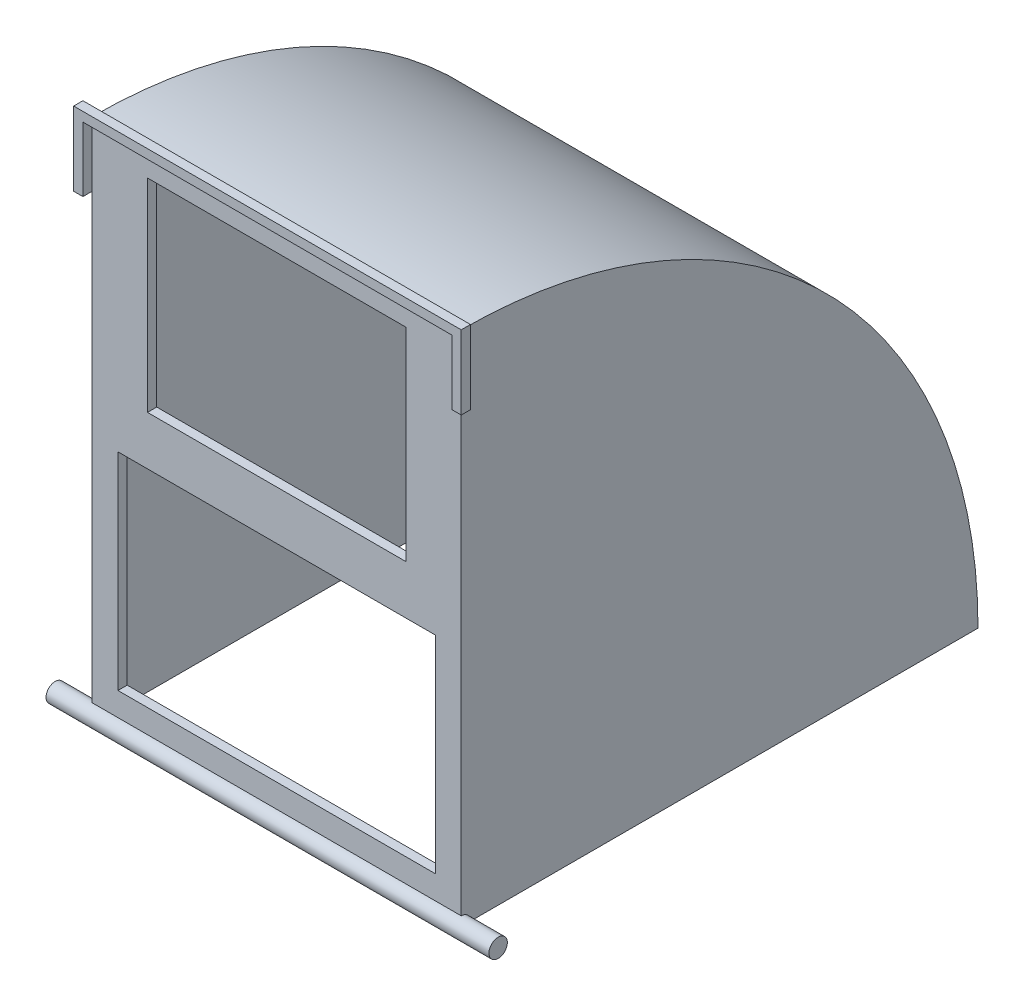
ISO-10303-21;
HEADER;
FILE_DESCRIPTION(('STEP AP214'),'2;1');
FILE_NAME('part.step','',(''),(''),'','','');
FILE_SCHEMA(('AUTOMOTIVE_DESIGN { 1 0 10303 214 1 1 1 1 }'));
ENDSEC;
DATA;
#1=APPLICATION_CONTEXT('core data for automotive mechanical design processes');
#2=APPLICATION_PROTOCOL_DEFINITION('international standard','automotive_design',2000,#1);
#3=PRODUCT_CONTEXT('',#1,'mechanical');
#4=PRODUCT('Part','Part','',(#3));
#5=PRODUCT_RELATED_PRODUCT_CATEGORY('part','',(#4));
#6=PRODUCT_DEFINITION_FORMATION('','',#4);
#7=PRODUCT_DEFINITION_CONTEXT('part definition',#1,'design');
#8=PRODUCT_DEFINITION('design','',#6,#7);
#9=PRODUCT_DEFINITION_SHAPE('','',#8);
#10=(LENGTH_UNIT() NAMED_UNIT(*) SI_UNIT(.MILLI.,.METRE.));
#11=(NAMED_UNIT(*) PLANE_ANGLE_UNIT() SI_UNIT($,.RADIAN.));
#12=(NAMED_UNIT(*) SI_UNIT($,.STERADIAN.) SOLID_ANGLE_UNIT());
#13=UNCERTAINTY_MEASURE_WITH_UNIT(LENGTH_MEASURE(1.E-05),#10,'distance_accuracy_value','');
#14=(GEOMETRIC_REPRESENTATION_CONTEXT(3) GLOBAL_UNCERTAINTY_ASSIGNED_CONTEXT((#13)) GLOBAL_UNIT_ASSIGNED_CONTEXT((#10,
#11,#12)) REPRESENTATION_CONTEXT('',''));
#15=CARTESIAN_POINT('',(0.,0.,0.));
#16=DIRECTION('',(0.,0.,1.));
#17=DIRECTION('',(1.,0.,0.));
#18=AXIS2_PLACEMENT_3D('',#15,#16,#17);
#19=CARTESIAN_POINT('',(127.,155.575,3.175));
#20=DIRECTION('',(1.,0.,0.));
#21=DIRECTION('',(0.,0.,-1.));
#22=AXIS2_PLACEMENT_3D('',#19,#20,#21);
#23=PLANE('',#22);
#24=DIRECTION('',(0.,-1.,0.));
#25=VECTOR('',#24,1.);
#26=CARTESIAN_POINT('',(127.,155.575,0.));
#27=LINE('',#26,#25);
#28=CARTESIAN_POINT('',(127.,177.8,0.));
#29=VERTEX_POINT('',#28);
#30=CARTESIAN_POINT('',(127.,155.575,0.));
#31=VERTEX_POINT('',#30);
#32=EDGE_CURVE('E140',#29,#31,#27,.T.);
#33=ORIENTED_EDGE('',*,*,#32,.T.);
#34=DIRECTION('',(0.,0.,-1.));
#35=VECTOR('',#34,1.);
#36=CARTESIAN_POINT('',(127.,155.575,3.175));
#37=LINE('',#36,#35);
#38=CARTESIAN_POINT('',(127.,155.575,3.175));
#39=VERTEX_POINT('',#38);
#40=EDGE_CURVE('E12',#39,#31,#37,.T.);
#41=ORIENTED_EDGE('',*,*,#40,.F.);
#42=DIRECTION('',(0.,-1.,0.));
#43=VECTOR('',#42,1.);
#44=CARTESIAN_POINT('',(127.,155.575,3.175));
#45=LINE('',#44,#43);
#46=CARTESIAN_POINT('',(127.,177.8,3.175));
#47=VERTEX_POINT('',#46);
#48=EDGE_CURVE('E154',#47,#39,#45,.T.);
#49=ORIENTED_EDGE('',*,*,#48,.F.);
#50=DIRECTION('',(0.,0.,-1.));
#51=VECTOR('',#50,1.);
#52=CARTESIAN_POINT('',(127.,177.8,3.175));
#53=LINE('',#52,#51);
#54=EDGE_CURVE('E136',#47,#29,#53,.T.);
#55=ORIENTED_EDGE('',*,*,#54,.T.);
#56=EDGE_LOOP('',(#33,#41,#49,#55));
#57=FACE_BOUND('',#56,.T.);
#58=ADVANCED_FACE('F44',(#57),#23,.F.);
#59=CARTESIAN_POINT('',(127.,155.575,3.175));
#60=DIRECTION('',(0.,1.,0.));
#61=DIRECTION('',(0.,0.,1.));
#62=AXIS2_PLACEMENT_3D('',#59,#60,#61);
#63=PLANE('',#62);
#64=DIRECTION('',(1.,0.,0.));
#65=VECTOR('',#64,1.);
#66=CARTESIAN_POINT('',(127.,155.575,0.));
#67=LINE('',#66,#65);
#68=CARTESIAN_POINT('',(130.175,155.575,0.));
#69=VERTEX_POINT('',#68);
#70=EDGE_CURVE('E143',#31,#69,#67,.T.);
#71=ORIENTED_EDGE('',*,*,#70,.T.);
#72=DIRECTION('',(0.,0.,-1.));
#73=VECTOR('',#72,1.);
#74=CARTESIAN_POINT('',(130.175,155.575,3.175));
#75=LINE('',#74,#73);
#76=CARTESIAN_POINT('',(130.175,155.575,3.175));
#77=VERTEX_POINT('',#76);
#78=EDGE_CURVE('E52',#77,#69,#75,.T.);
#79=ORIENTED_EDGE('',*,*,#78,.F.);
#80=DIRECTION('',(1.,0.,0.));
#81=VECTOR('',#80,1.);
#82=CARTESIAN_POINT('',(127.,155.575,3.175));
#83=LINE('',#82,#81);
#84=EDGE_CURVE('E103',#39,#77,#83,.T.);
#85=ORIENTED_EDGE('',*,*,#84,.F.);
#86=ORIENTED_EDGE('',*,*,#40,.T.);
#87=EDGE_LOOP('',(#71,#79,#85,#86));
#88=FACE_BOUND('',#87,.T.);
#89=ADVANCED_FACE('F189',(#88),#63,.F.);
#90=CARTESIAN_POINT('',(130.175,180.975,3.175));
#91=DIRECTION('',(-1.,0.,0.));
#92=DIRECTION('',(0.,0.,1.));
#93=AXIS2_PLACEMENT_3D('',#90,#91,#92);
#94=PLANE('',#93);
#95=DIRECTION('',(0.,1.,0.));
#96=VECTOR('',#95,1.);
#97=CARTESIAN_POINT('',(130.175,180.975,0.));
#98=LINE('',#97,#96);
#99=CARTESIAN_POINT('',(130.175,180.975,0.));
#100=VERTEX_POINT('',#99);
#101=EDGE_CURVE('E145',#69,#100,#98,.T.);
#102=ORIENTED_EDGE('',*,*,#101,.T.);
#103=DIRECTION('',(0.,0.,-1.));
#104=VECTOR('',#103,1.);
#105=CARTESIAN_POINT('',(130.175,180.975,3.175));
#106=LINE('',#105,#104);
#107=CARTESIAN_POINT('',(130.175,180.975,3.175));
#108=VERTEX_POINT('',#107);
#109=EDGE_CURVE('E161',#108,#100,#106,.T.);
#110=ORIENTED_EDGE('',*,*,#109,.F.);
#111=DIRECTION('',(0.,1.,0.));
#112=VECTOR('',#111,1.);
#113=CARTESIAN_POINT('',(130.175,180.975,3.175));
#114=LINE('',#113,#112);
#115=EDGE_CURVE('E169',#77,#108,#114,.T.);
#116=ORIENTED_EDGE('',*,*,#115,.F.);
#117=ORIENTED_EDGE('',*,*,#78,.T.);
#118=EDGE_LOOP('',(#102,#110,#116,#117));
#119=FACE_BOUND('',#118,.T.);
#120=ADVANCED_FACE('F167',(#119),#94,.F.);
#121=CARTESIAN_POINT('',(-3.17500000000001,180.975,3.175));
#122=DIRECTION('',(0.,-1.,0.));
#123=DIRECTION('',(0.,0.,-1.));
#124=AXIS2_PLACEMENT_3D('',#121,#122,#123);
#125=PLANE('',#124);
#126=DIRECTION('',(-1.,0.,0.));
#127=VECTOR('',#126,1.);
#128=CARTESIAN_POINT('',(-3.17500000000001,180.975,0.));
#129=LINE('',#128,#127);
#130=CARTESIAN_POINT('',(-3.17500000000001,180.975,0.));
#131=VERTEX_POINT('',#130);
#132=EDGE_CURVE('E147',#100,#131,#129,.T.);
#133=ORIENTED_EDGE('',*,*,#132,.T.);
#134=DIRECTION('',(0.,0.,-1.));
#135=VECTOR('',#134,1.);
#136=CARTESIAN_POINT('',(-3.17500000000001,180.975,3.175));
#137=LINE('',#136,#135);
#138=CARTESIAN_POINT('',(-3.17500000000001,180.975,3.175));
#139=VERTEX_POINT('',#138);
#140=EDGE_CURVE('E158',#139,#131,#137,.T.);
#141=ORIENTED_EDGE('',*,*,#140,.F.);
#142=DIRECTION('',(-1.,0.,0.));
#143=VECTOR('',#142,1.);
#144=CARTESIAN_POINT('',(-3.17500000000001,180.975,3.175));
#145=LINE('',#144,#143);
#146=EDGE_CURVE('E181',#108,#139,#145,.T.);
#147=ORIENTED_EDGE('',*,*,#146,.F.);
#148=ORIENTED_EDGE('',*,*,#109,.T.);
#149=EDGE_LOOP('',(#133,#141,#147,#148));
#150=FACE_BOUND('',#149,.T.);
#151=ADVANCED_FACE('F177',(#150),#125,.F.);
#152=CARTESIAN_POINT('',(-3.17500000000001,155.575,3.175));
#153=DIRECTION('',(1.,0.,0.));
#154=DIRECTION('',(0.,0.,-1.));
#155=AXIS2_PLACEMENT_3D('',#152,#153,#154);
#156=PLANE('',#155);
#157=DIRECTION('',(0.,-1.,0.));
#158=VECTOR('',#157,1.);
#159=CARTESIAN_POINT('',(-3.17500000000001,155.575,0.));
#160=LINE('',#159,#158);
#161=CARTESIAN_POINT('',(-3.17500000000001,155.575,0.));
#162=VERTEX_POINT('',#161);
#163=EDGE_CURVE('E149',#131,#162,#160,.T.);
#164=ORIENTED_EDGE('',*,*,#163,.T.);
#165=DIRECTION('',(0.,0.,-1.));
#166=VECTOR('',#165,1.);
#167=CARTESIAN_POINT('',(-3.17500000000001,155.575,3.175));
#168=LINE('',#167,#166);
#169=CARTESIAN_POINT('',(-3.17500000000001,155.575,3.175));
#170=VERTEX_POINT('',#169);
#171=EDGE_CURVE('E131',#170,#162,#168,.T.);
#172=ORIENTED_EDGE('',*,*,#171,.F.);
#173=DIRECTION('',(0.,-1.,0.));
#174=VECTOR('',#173,1.);
#175=CARTESIAN_POINT('',(-3.17500000000001,155.575,3.175));
#176=LINE('',#175,#174);
#177=EDGE_CURVE('E122',#139,#170,#176,.T.);
#178=ORIENTED_EDGE('',*,*,#177,.F.);
#179=ORIENTED_EDGE('',*,*,#140,.T.);
#180=EDGE_LOOP('',(#164,#172,#178,#179));
#181=FACE_BOUND('',#180,.T.);
#182=ADVANCED_FACE('F180',(#181),#156,.F.);
#183=CARTESIAN_POINT('',(0.,155.575,3.175));
#184=DIRECTION('',(0.,1.,0.));
#185=DIRECTION('',(0.,0.,1.));
#186=AXIS2_PLACEMENT_3D('',#183,#184,#185);
#187=PLANE('',#186);
#188=DIRECTION('',(1.,0.,0.));
#189=VECTOR('',#188,1.);
#190=CARTESIAN_POINT('',(0.,155.575,0.));
#191=LINE('',#190,#189);
#192=CARTESIAN_POINT('',(0.,155.575,0.));
#193=VERTEX_POINT('',#192);
#194=EDGE_CURVE('E130',#162,#193,#191,.T.);
#195=ORIENTED_EDGE('',*,*,#194,.T.);
#196=DIRECTION('',(0.,0.,-1.));
#197=VECTOR('',#196,1.);
#198=CARTESIAN_POINT('',(0.,155.575,3.175));
#199=LINE('',#198,#197);
#200=CARTESIAN_POINT('',(0.,155.575,3.175));
#201=VERTEX_POINT('',#200);
#202=EDGE_CURVE('E127',#201,#193,#199,.T.);
#203=ORIENTED_EDGE('',*,*,#202,.F.);
#204=DIRECTION('',(1.,0.,0.));
#205=VECTOR('',#204,1.);
#206=CARTESIAN_POINT('',(0.,155.575,3.175));
#207=LINE('',#206,#205);
#208=EDGE_CURVE('E116',#170,#201,#207,.T.);
#209=ORIENTED_EDGE('',*,*,#208,.F.);
#210=ORIENTED_EDGE('',*,*,#171,.T.);
#211=EDGE_LOOP('',(#195,#203,#209,#210));
#212=FACE_BOUND('',#211,.T.);
#213=ADVANCED_FACE('F128',(#212),#187,.F.);
#214=CARTESIAN_POINT('',(0.,155.575,3.175));
#215=DIRECTION('',(-1.,0.,0.));
#216=DIRECTION('',(0.,-1.,0.));
#217=AXIS2_PLACEMENT_3D('',#214,#215,#216);
#218=PLANE('',#217);
#219=DIRECTION('',(0.,1.,0.));
#220=VECTOR('',#219,1.);
#221=CARTESIAN_POINT('',(0.,155.575,0.));
#222=LINE('',#221,#220);
#223=CARTESIAN_POINT('',(0.,177.8,0.));
#224=VERTEX_POINT('',#223);
#225=EDGE_CURVE('E89',#193,#224,#222,.T.);
#226=ORIENTED_EDGE('',*,*,#225,.T.);
#227=DIRECTION('',(0.,0.,-1.));
#228=VECTOR('',#227,1.);
#229=CARTESIAN_POINT('',(0.,177.8,3.175));
#230=LINE('',#229,#228);
#231=CARTESIAN_POINT('',(0.,177.8,3.175));
#232=VERTEX_POINT('',#231);
#233=EDGE_CURVE('E132',#232,#224,#230,.T.);
#234=ORIENTED_EDGE('',*,*,#233,.F.);
#235=DIRECTION('',(0.,1.,0.));
#236=VECTOR('',#235,1.);
#237=CARTESIAN_POINT('',(0.,155.575,3.175));
#238=LINE('',#237,#236);
#239=EDGE_CURVE('E120',#201,#232,#238,.T.);
#240=ORIENTED_EDGE('',*,*,#239,.F.);
#241=ORIENTED_EDGE('',*,*,#202,.T.);
#242=EDGE_LOOP('',(#226,#234,#240,#241));
#243=FACE_BOUND('',#242,.T.);
#244=ADVANCED_FACE('F134',(#243),#218,.F.);
#245=CARTESIAN_POINT('',(127.,177.8,3.175));
#246=DIRECTION('',(0.,1.,0.));
#247=DIRECTION('',(0.,0.,1.));
#248=AXIS2_PLACEMENT_3D('',#245,#246,#247);
#249=PLANE('',#248);
#250=DIRECTION('',(1.,0.,0.));
#251=VECTOR('',#250,1.);
#252=CARTESIAN_POINT('',(127.,177.8,0.));
#253=LINE('',#252,#251);
#254=EDGE_CURVE('E95',#224,#29,#253,.T.);
#255=ORIENTED_EDGE('',*,*,#254,.T.);
#256=ORIENTED_EDGE('',*,*,#54,.F.);
#257=DIRECTION('',(1.,0.,0.));
#258=VECTOR('',#257,1.);
#259=CARTESIAN_POINT('',(127.,177.8,3.175));
#260=LINE('',#259,#258);
#261=EDGE_CURVE('E60',#232,#47,#260,.T.);
#262=ORIENTED_EDGE('',*,*,#261,.F.);
#263=ORIENTED_EDGE('',*,*,#233,.T.);
#264=EDGE_LOOP('',(#255,#256,#262,#263));
#265=FACE_BOUND('',#264,.T.);
#266=ADVANCED_FACE('F205',(#265),#249,.F.);
#267=CARTESIAN_POINT('',(0.,0.,3.175));
#268=DIRECTION('',(0.,0.,1.));
#269=DIRECTION('',(1.,0.,0.));
#270=AXIS2_PLACEMENT_3D('',#267,#268,#269);
#271=PLANE('',#270);
#272=ORIENTED_EDGE('',*,*,#48,.T.);
#273=ORIENTED_EDGE('',*,*,#84,.T.);
#274=ORIENTED_EDGE('',*,*,#115,.T.);
#275=ORIENTED_EDGE('',*,*,#146,.T.);
#276=ORIENTED_EDGE('',*,*,#177,.T.);
#277=ORIENTED_EDGE('',*,*,#208,.T.);
#278=ORIENTED_EDGE('',*,*,#239,.T.);
#279=ORIENTED_EDGE('',*,*,#261,.T.);
#280=EDGE_LOOP('',(#272,#273,#274,#275,#276,#277,#278,#279));
#281=FACE_BOUND('',#280,.T.);
#282=ADVANCED_FACE('F118',(#281),#271,.T.);
#283=CARTESIAN_POINT('',(0.,0.,0.));
#284=DIRECTION('',(0.,0.,1.));
#285=DIRECTION('',(1.,0.,0.));
#286=AXIS2_PLACEMENT_3D('',#283,#284,#285);
#287=PLANE('',#286);
#288=ORIENTED_EDGE('',*,*,#32,.F.);
#289=ORIENTED_EDGE('',*,*,#254,.F.);
#290=ORIENTED_EDGE('',*,*,#225,.F.);
#291=ORIENTED_EDGE('',*,*,#194,.F.);
#292=ORIENTED_EDGE('',*,*,#163,.F.);
#293=ORIENTED_EDGE('',*,*,#132,.F.);
#294=ORIENTED_EDGE('',*,*,#101,.F.);
#295=ORIENTED_EDGE('',*,*,#70,.F.);
#296=EDGE_LOOP('',(#288,#289,#290,#291,#292,#293,#294,#295));
#297=FACE_BOUND('',#296,.T.);
#298=ADVANCED_FACE('F173',(#297),#287,.F.);
#299=CLOSED_SHELL('',(#58,#89,#120,#151,#182,#213,#244,#266,#282,#298));
#300=MANIFOLD_SOLID_BREP('B2',#299);
#301=CARTESIAN_POINT('',(139.701,174.596133977817,-3.175));
#302=DIRECTION('',(0.,0.,1.));
#303=DIRECTION('',(1.,0.,0.));
#304=AXIS2_PLACEMENT_3D('',#301,#302,#303);
#305=PLANE('',#304);
#306=DIRECTION('',(0.,-1.,0.));
#307=VECTOR('',#306,1.);
#308=CARTESIAN_POINT('',(19.05,174.596133977817,-3.175));
#309=LINE('',#308,#307);
#310=CARTESIAN_POINT('',(19.05,169.06875,-3.175));
#311=VERTEX_POINT('',#310);
#312=CARTESIAN_POINT('',(19.05,99.21875,-3.175));
#313=VERTEX_POINT('',#312);
#314=EDGE_CURVE('E466',#311,#313,#309,.T.);
#315=ORIENTED_EDGE('',*,*,#314,.T.);
#316=DIRECTION('',(1.,0.,0.));
#317=VECTOR('',#316,1.);
#318=CARTESIAN_POINT('',(139.701,99.21875,-3.175));
#319=LINE('',#318,#317);
#320=CARTESIAN_POINT('',(107.95,99.21875,-3.175));
#321=VERTEX_POINT('',#320);
#322=EDGE_CURVE('E458',#313,#321,#319,.T.);
#323=ORIENTED_EDGE('',*,*,#322,.T.);
#324=DIRECTION('',(0.,1.,0.));
#325=VECTOR('',#324,1.);
#326=CARTESIAN_POINT('',(107.95,174.596133977817,-3.175));
#327=LINE('',#326,#325);
#328=CARTESIAN_POINT('',(107.95,169.06875,-3.175));
#329=VERTEX_POINT('',#328);
#330=EDGE_CURVE('E462',#321,#329,#327,.T.);
#331=ORIENTED_EDGE('',*,*,#330,.T.);
#332=DIRECTION('',(-1.,0.,0.));
#333=VECTOR('',#332,1.);
#334=CARTESIAN_POINT('',(139.701,169.06875,-3.175));
#335=LINE('',#334,#333);
#336=EDGE_CURVE('E464',#329,#311,#335,.T.);
#337=ORIENTED_EDGE('',*,*,#336,.T.);
#338=EDGE_LOOP('',(#315,#323,#331,#337));
#339=FACE_BOUND('',#338,.T.);
#340=DIRECTION('',(0.,-1.,0.));
#341=VECTOR('',#340,1.);
#342=CARTESIAN_POINT('',(8.89000000000001,174.596133977817,-3.175));
#343=LINE('',#342,#341);
#344=CARTESIAN_POINT('',(8.89000000000001,82.39125,-3.175));
#345=VERTEX_POINT('',#344);
#346=CARTESIAN_POINT('',(8.89000000000003,11.27125,-3.175));
#347=VERTEX_POINT('',#346);
#348=EDGE_CURVE('E474',#345,#347,#343,.T.);
#349=ORIENTED_EDGE('',*,*,#348,.T.);
#350=DIRECTION('',(1.,0.,0.));
#351=VECTOR('',#350,1.);
#352=CARTESIAN_POINT('',(139.701,11.27125,-3.175));
#353=LINE('',#352,#351);
#354=CARTESIAN_POINT('',(118.11,11.27125,-3.175));
#355=VERTEX_POINT('',#354);
#356=EDGE_CURVE('E468',#347,#355,#353,.T.);
#357=ORIENTED_EDGE('',*,*,#356,.T.);
#358=DIRECTION('',(0.,1.,0.));
#359=VECTOR('',#358,1.);
#360=CARTESIAN_POINT('',(118.11,174.596133977817,-3.175));
#361=LINE('',#360,#359);
#362=CARTESIAN_POINT('',(118.11,82.39125,-3.175));
#363=VERTEX_POINT('',#362);
#364=EDGE_CURVE('E470',#355,#363,#361,.T.);
#365=ORIENTED_EDGE('',*,*,#364,.T.);
#366=DIRECTION('',(-1.,0.,0.));
#367=VECTOR('',#366,1.);
#368=CARTESIAN_POINT('',(139.701,82.39125,-3.175));
#369=LINE('',#368,#367);
#370=EDGE_CURVE('E472',#363,#345,#369,.T.);
#371=ORIENTED_EDGE('',*,*,#370,.T.);
#372=EDGE_LOOP('',(#349,#357,#365,#371));
#373=FACE_BOUND('',#372,.T.);
#374=DIRECTION('',(0.,1.,0.));
#375=VECTOR('',#374,1.);
#376=CARTESIAN_POINT('',(123.825,174.596133977817,-3.175));
#377=LINE('',#376,#375);
#378=CARTESIAN_POINT('',(123.825,3.17500000000001,-3.175));
#379=VERTEX_POINT('',#378);
#380=CARTESIAN_POINT('',(123.825,174.596133977817,-3.17499999999998));
#381=VERTEX_POINT('',#380);
#382=EDGE_CURVE('E286',#379,#381,#377,.T.);
#383=ORIENTED_EDGE('',*,*,#382,.F.);
#384=DIRECTION('',(-1.,0.,0.));
#385=VECTOR('',#384,1.);
#386=CARTESIAN_POINT('',(139.701,3.17500000000001,-3.175));
#387=LINE('',#386,#385);
#388=CARTESIAN_POINT('',(3.17500000000001,3.17500000000001,-3.175));
#389=VERTEX_POINT('',#388);
#390=EDGE_CURVE('E408',#379,#389,#387,.T.);
#391=ORIENTED_EDGE('',*,*,#390,.T.);
#392=DIRECTION('',(0.,-1.,0.));
#393=VECTOR('',#392,1.);
#394=CARTESIAN_POINT('',(3.17500000000001,174.596133977817,-3.175));
#395=LINE('',#394,#393);
#396=CARTESIAN_POINT('',(3.17500000000001,174.596133977817,-3.17499999999998));
#397=VERTEX_POINT('',#396);
#398=EDGE_CURVE('E422',#397,#389,#395,.T.);
#399=ORIENTED_EDGE('',*,*,#398,.F.);
#400=DIRECTION('',(-1.,0.,0.));
#401=VECTOR('',#400,1.);
#402=CARTESIAN_POINT('',(139.701,174.596133977817,-3.17499999999998));
#403=LINE('',#402,#401);
#404=EDGE_CURVE('E409',#381,#397,#403,.T.);
#405=ORIENTED_EDGE('',*,*,#404,.F.);
#406=EDGE_LOOP('',(#383,#391,#399,#405));
#407=FACE_BOUND('',#406,.T.);
#408=ADVANCED_FACE('F271',(#339,#373,#407),#305,.F.);
#409=CARTESIAN_POINT('',(139.701,3.17500000000001,-3.175));
#410=DIRECTION('',(0.,-1.,0.));
#411=DIRECTION('',(0.,0.,-1.));
#412=AXIS2_PLACEMENT_3D('',#409,#410,#411);
#413=PLANE('',#412);
#414=DIRECTION('',(0.,0.,1.));
#415=VECTOR('',#414,1.);
#416=CARTESIAN_POINT('',(123.825,3.17500000000001,-3.175));
#417=LINE('',#416,#415);
#418=CARTESIAN_POINT('',(123.825,3.17500000000001,-6.35));
#419=VERTEX_POINT('',#418);
#420=EDGE_CURVE('E424',#419,#379,#417,.T.);
#421=ORIENTED_EDGE('',*,*,#420,.F.);
#422=DIRECTION('',(1.,0.,0.));
#423=VECTOR('',#422,1.);
#424=CARTESIAN_POINT('',(123.825,3.17500000000001,-6.35));
#425=LINE('',#424,#423);
#426=CARTESIAN_POINT('',(3.175,3.17500000000001,-6.35));
#427=VERTEX_POINT('',#426);
#428=EDGE_CURVE('E434',#427,#419,#425,.T.);
#429=ORIENTED_EDGE('',*,*,#428,.F.);
#430=DIRECTION('',(0.,0.,-1.));
#431=VECTOR('',#430,1.);
#432=CARTESIAN_POINT('',(3.17500000000001,3.17500000000001,-3.175));
#433=LINE('',#432,#431);
#434=EDGE_CURVE('E428',#389,#427,#433,.T.);
#435=ORIENTED_EDGE('',*,*,#434,.F.);
#436=ORIENTED_EDGE('',*,*,#390,.F.);
#437=EDGE_LOOP('',(#421,#429,#435,#436));
#438=FACE_BOUND('',#437,.T.);
#439=ADVANCED_FACE('F589',(#438),#413,.F.);
#440=CARTESIAN_POINT('',(139.701,0.,0.));
#441=DIRECTION('',(-1.,0.,0.));
#442=DIRECTION('',(0.,0.,1.));
#443=AXIS2_PLACEMENT_3D('',#440,#441,#442);
#444=CYLINDRICAL_SURFACE('',#443,174.625);
#445=CARTESIAN_POINT('',(123.825,0.,0.));
#446=DIRECTION('',(1.,0.,0.));
#447=DIRECTION('',(0.,0.,-1.));
#448=AXIS2_PLACEMENT_3D('',#445,#446,#447);
#449=CIRCLE('',#448,174.625);
#450=CARTESIAN_POINT('',(123.825,3.175,-174.596133977817));
#451=VERTEX_POINT('',#450);
#452=EDGE_CURVE('E294',#381,#451,#449,.F.);
#453=ORIENTED_EDGE('',*,*,#452,.F.);
#454=ORIENTED_EDGE('',*,*,#404,.T.);
#455=CARTESIAN_POINT('',(3.17500000000001,0.,0.));
#456=DIRECTION('',(-1.,0.,0.));
#457=DIRECTION('',(0.,0.,1.));
#458=AXIS2_PLACEMENT_3D('',#455,#456,#457);
#459=CIRCLE('',#458,174.625);
#460=CARTESIAN_POINT('',(3.175,3.17500000000001,-174.596133977817));
#461=VERTEX_POINT('',#460);
#462=EDGE_CURVE('E404',#461,#397,#459,.F.);
#463=ORIENTED_EDGE('',*,*,#462,.F.);
#464=DIRECTION('',(-1.,0.,0.));
#465=VECTOR('',#464,1.);
#466=CARTESIAN_POINT('',(139.701,3.175,-174.596133977817));
#467=LINE('',#466,#465);
#468=EDGE_CURVE('E400',#451,#461,#467,.T.);
#469=ORIENTED_EDGE('',*,*,#468,.F.);
#470=EDGE_LOOP('',(#453,#454,#463,#469));
#471=FACE_BOUND('',#470,.T.);
#472=ADVANCED_FACE('F402',(#471),#444,.F.);
#473=CARTESIAN_POINT('',(127.,0.,0.));
#474=DIRECTION('',(0.,1.,0.));
#475=DIRECTION('',(0.,0.,1.));
#476=AXIS2_PLACEMENT_3D('',#473,#474,#475);
#477=PLANE('',#476);
#478=DIRECTION('',(0.,0.,1.));
#479=VECTOR('',#478,1.);
#480=CARTESIAN_POINT('',(123.825,0.,-174.625));
#481=LINE('',#480,#479);
#482=CARTESIAN_POINT('',(123.825,0.,-174.625));
#483=VERTEX_POINT('',#482);
#484=CARTESIAN_POINT('',(123.825,0.,-6.35));
#485=VERTEX_POINT('',#484);
#486=EDGE_CURVE('E443',#483,#485,#481,.T.);
#487=ORIENTED_EDGE('',*,*,#486,.F.);
#488=DIRECTION('',(1.,0.,0.));
#489=VECTOR('',#488,1.);
#490=CARTESIAN_POINT('',(3.175,0.,-174.625));
#491=LINE('',#490,#489);
#492=CARTESIAN_POINT('',(3.175,0.,-174.625));
#493=VERTEX_POINT('',#492);
#494=EDGE_CURVE('E430',#493,#483,#491,.T.);
#495=ORIENTED_EDGE('',*,*,#494,.F.);
#496=DIRECTION('',(0.,0.,-1.));
#497=VECTOR('',#496,1.);
#498=CARTESIAN_POINT('',(3.175,0.,-6.35));
#499=LINE('',#498,#497);
#500=CARTESIAN_POINT('',(3.175,0.,-6.35));
#501=VERTEX_POINT('',#500);
#502=EDGE_CURVE('E448',#501,#493,#499,.T.);
#503=ORIENTED_EDGE('',*,*,#502,.F.);
#504=DIRECTION('',(-1.,0.,0.));
#505=VECTOR('',#504,1.);
#506=CARTESIAN_POINT('',(123.825,0.,-6.35));
#507=LINE('',#506,#505);
#508=EDGE_CURVE('E445',#485,#501,#507,.T.);
#509=ORIENTED_EDGE('',*,*,#508,.F.);
#510=EDGE_LOOP('',(#487,#495,#503,#509));
#511=FACE_BOUND('',#510,.T.);
#512=DIRECTION('',(0.,0.,-1.));
#513=VECTOR('',#512,1.);
#514=CARTESIAN_POINT('',(127.,0.,0.));
#515=LINE('',#514,#513);
#516=CARTESIAN_POINT('',(127.,0.,-3.175));
#517=VERTEX_POINT('',#516);
#518=CARTESIAN_POINT('',(127.,0.,-177.8));
#519=VERTEX_POINT('',#518);
#520=EDGE_CURVE('E531',#517,#519,#515,.T.);
#521=ORIENTED_EDGE('',*,*,#520,.F.);
#522=DIRECTION('',(1.,0.,0.));
#523=VECTOR('',#522,1.);
#524=CARTESIAN_POINT('',(-12.7,0.,-3.175));
#525=LINE('',#524,#523);
#526=CARTESIAN_POINT('',(0.,0.,-3.175));
#527=VERTEX_POINT('',#526);
#528=EDGE_CURVE('E525',#517,#527,#525,.F.);
#529=ORIENTED_EDGE('',*,*,#528,.T.);
#530=DIRECTION('',(0.,0.,-1.));
#531=VECTOR('',#530,1.);
#532=CARTESIAN_POINT('',(0.,0.,0.));
#533=LINE('',#532,#531);
#534=CARTESIAN_POINT('',(0.,0.,-177.8));
#535=VERTEX_POINT('',#534);
#536=EDGE_CURVE('E530',#527,#535,#533,.T.);
#537=ORIENTED_EDGE('',*,*,#536,.T.);
#538=DIRECTION('',(-1.,0.,0.));
#539=VECTOR('',#538,1.);
#540=CARTESIAN_POINT('',(127.,0.,-177.8));
#541=LINE('',#540,#539);
#542=EDGE_CURVE('E279',#519,#535,#541,.T.);
#543=ORIENTED_EDGE('',*,*,#542,.F.);
#544=EDGE_LOOP('',(#521,#529,#537,#543));
#545=FACE_BOUND('',#544,.T.);
#546=ADVANCED_FACE('F273',(#511,#545),#477,.F.);
#547=CARTESIAN_POINT('',(127.,0.,0.));
#548=DIRECTION('',(-1.,0.,0.));
#549=DIRECTION('',(0.,0.,1.));
#550=AXIS2_PLACEMENT_3D('',#547,#548,#549);
#551=CYLINDRICAL_SURFACE('',#550,177.8);
#552=CARTESIAN_POINT('',(0.,0.,0.));
#553=DIRECTION('',(1.,0.,0.));
#554=DIRECTION('',(0.,0.,-1.));
#555=AXIS2_PLACEMENT_3D('',#552,#553,#554);
#556=CIRCLE('',#555,177.8);
#557=CARTESIAN_POINT('',(0.,177.8,0.));
#558=VERTEX_POINT('',#557);
#559=EDGE_CURVE('E541',#535,#558,#556,.T.);
#560=ORIENTED_EDGE('',*,*,#559,.T.);
#561=DIRECTION('',(-1.,0.,0.));
#562=VECTOR('',#561,1.);
#563=CARTESIAN_POINT('',(127.,177.8,0.));
#564=LINE('',#563,#562);
#565=CARTESIAN_POINT('',(127.,177.8,0.));
#566=VERTEX_POINT('',#565);
#567=EDGE_CURVE('E539',#566,#558,#564,.T.);
#568=ORIENTED_EDGE('',*,*,#567,.F.);
#569=CARTESIAN_POINT('',(127.,0.,0.));
#570=DIRECTION('',(1.,0.,0.));
#571=DIRECTION('',(0.,0.,-1.));
#572=AXIS2_PLACEMENT_3D('',#569,#570,#571);
#573=CIRCLE('',#572,177.8);
#574=EDGE_CURVE('E533',#519,#566,#573,.T.);
#575=ORIENTED_EDGE('',*,*,#574,.F.);
#576=ORIENTED_EDGE('',*,*,#542,.T.);
#577=EDGE_LOOP('',(#560,#568,#575,#576));
#578=FACE_BOUND('',#577,.T.);
#579=ADVANCED_FACE('F550',(#578),#551,.T.);
#580=CARTESIAN_POINT('',(127.,0.,0.));
#581=DIRECTION('',(0.,0.,-1.));
#582=DIRECTION('',(-1.,0.,0.));
#583=AXIS2_PLACEMENT_3D('',#580,#581,#582);
#584=PLANE('',#583);
#585=DIRECTION('',(1.,0.,0.));
#586=VECTOR('',#585,1.);
#587=CARTESIAN_POINT('',(107.95,99.21875,0.));
#588=LINE('',#587,#586);
#589=CARTESIAN_POINT('',(19.05,99.21875,0.));
#590=VERTEX_POINT('',#589);
#591=CARTESIAN_POINT('',(107.95,99.21875,0.));
#592=VERTEX_POINT('',#591);
#593=EDGE_CURVE('E480',#590,#592,#588,.T.);
#594=ORIENTED_EDGE('',*,*,#593,.F.);
#595=DIRECTION('',(0.,-1.,0.));
#596=VECTOR('',#595,1.);
#597=CARTESIAN_POINT('',(19.05,169.06875,0.));
#598=LINE('',#597,#596);
#599=CARTESIAN_POINT('',(19.05,169.06875,0.));
#600=VERTEX_POINT('',#599);
#601=EDGE_CURVE('E477',#600,#590,#598,.T.);
#602=ORIENTED_EDGE('',*,*,#601,.F.);
#603=DIRECTION('',(-1.,0.,0.));
#604=VECTOR('',#603,1.);
#605=CARTESIAN_POINT('',(107.95,169.06875,0.));
#606=LINE('',#605,#604);
#607=CARTESIAN_POINT('',(107.95,169.06875,0.));
#608=VERTEX_POINT('',#607);
#609=EDGE_CURVE('E487',#608,#600,#606,.T.);
#610=ORIENTED_EDGE('',*,*,#609,.F.);
#611=DIRECTION('',(0.,1.,0.));
#612=VECTOR('',#611,1.);
#613=CARTESIAN_POINT('',(107.95,169.06875,0.));
#614=LINE('',#613,#612);
#615=EDGE_CURVE('E484',#592,#608,#614,.T.);
#616=ORIENTED_EDGE('',*,*,#615,.F.);
#617=EDGE_LOOP('',(#594,#602,#610,#616));
#618=FACE_BOUND('',#617,.T.);
#619=DIRECTION('',(1.,0.,0.));
#620=VECTOR('',#619,1.);
#621=CARTESIAN_POINT('',(118.11,11.27125,0.));
#622=LINE('',#621,#620);
#623=CARTESIAN_POINT('',(8.89000000000004,11.27125,0.));
#624=VERTEX_POINT('',#623);
#625=CARTESIAN_POINT('',(118.11,11.27125,0.));
#626=VERTEX_POINT('',#625);
#627=EDGE_CURVE('E501',#624,#626,#622,.T.);
#628=ORIENTED_EDGE('',*,*,#627,.F.);
#629=DIRECTION('',(0.,-1.,0.));
#630=VECTOR('',#629,1.);
#631=CARTESIAN_POINT('',(8.89000000000002,82.39125,0.));
#632=LINE('',#631,#630);
#633=CARTESIAN_POINT('',(8.89000000000002,82.39125,0.));
#634=VERTEX_POINT('',#633);
#635=EDGE_CURVE('E476',#634,#624,#632,.T.);
#636=ORIENTED_EDGE('',*,*,#635,.F.);
#637=DIRECTION('',(-1.,0.,0.));
#638=VECTOR('',#637,1.);
#639=CARTESIAN_POINT('',(118.11,82.39125,0.));
#640=LINE('',#639,#638);
#641=CARTESIAN_POINT('',(118.11,82.39125,0.));
#642=VERTEX_POINT('',#641);
#643=EDGE_CURVE('E507',#642,#634,#640,.T.);
#644=ORIENTED_EDGE('',*,*,#643,.F.);
#645=DIRECTION('',(0.,1.,0.));
#646=VECTOR('',#645,1.);
#647=CARTESIAN_POINT('',(118.11,82.39125,0.));
#648=LINE('',#647,#646);
#649=EDGE_CURVE('E504',#626,#642,#648,.T.);
#650=ORIENTED_EDGE('',*,*,#649,.F.);
#651=EDGE_LOOP('',(#628,#636,#644,#650));
#652=FACE_BOUND('',#651,.T.);
#653=DIRECTION('',(0.,-1.,0.));
#654=VECTOR('',#653,1.);
#655=CARTESIAN_POINT('',(0.,0.,0.));
#656=LINE('',#655,#654);
#657=CARTESIAN_POINT('',(0.,3.175,0.));
#658=VERTEX_POINT('',#657);
#659=EDGE_CURVE('E534',#558,#658,#656,.T.);
#660=ORIENTED_EDGE('',*,*,#659,.T.);
#661=DIRECTION('',(1.,0.,0.));
#662=VECTOR('',#661,1.);
#663=CARTESIAN_POINT('',(-12.7,3.175,0.));
#664=LINE('',#663,#662);
#665=CARTESIAN_POINT('',(127.,3.175,0.));
#666=VERTEX_POINT('',#665);
#667=EDGE_CURVE('E522',#658,#666,#664,.T.);
#668=ORIENTED_EDGE('',*,*,#667,.T.);
#669=DIRECTION('',(0.,-1.,0.));
#670=VECTOR('',#669,1.);
#671=CARTESIAN_POINT('',(127.,0.,0.));
#672=LINE('',#671,#670);
#673=EDGE_CURVE('E536',#566,#666,#672,.T.);
#674=ORIENTED_EDGE('',*,*,#673,.F.);
#675=ORIENTED_EDGE('',*,*,#567,.T.);
#676=EDGE_LOOP('',(#660,#668,#674,#675));
#677=FACE_BOUND('',#676,.T.);
#678=ADVANCED_FACE('F560',(#618,#652,#677),#584,.F.);
#679=CARTESIAN_POINT('',(127.,0.,0.));
#680=DIRECTION('',(1.,0.,0.));
#681=DIRECTION('',(0.,0.,-1.));
#682=AXIS2_PLACEMENT_3D('',#679,#680,#681);
#683=PLANE('',#682);
#684=CARTESIAN_POINT('',(127.,0.,0.));
#685=DIRECTION('',(1.,0.,0.));
#686=DIRECTION('',(0.,0.,-1.));
#687=AXIS2_PLACEMENT_3D('',#684,#685,#686);
#688=CIRCLE('',#687,3.175);
#689=EDGE_CURVE('E528',#517,#666,#688,.T.);
#690=ORIENTED_EDGE('',*,*,#689,.F.);
#691=ORIENTED_EDGE('',*,*,#520,.T.);
#692=ORIENTED_EDGE('',*,*,#574,.T.);
#693=ORIENTED_EDGE('',*,*,#673,.T.);
#694=EDGE_LOOP('',(#690,#691,#692,#693));
#695=FACE_BOUND('',#694,.T.);
#696=ADVANCED_FACE('F564',(#695),#683,.T.);
#697=CARTESIAN_POINT('',(0.,0.,0.));
#698=DIRECTION('',(1.,0.,0.));
#699=DIRECTION('',(0.,0.,-1.));
#700=AXIS2_PLACEMENT_3D('',#697,#698,#699);
#701=PLANE('',#700);
#702=ORIENTED_EDGE('',*,*,#536,.F.);
#703=CARTESIAN_POINT('',(0.,0.,0.));
#704=DIRECTION('',(1.,0.,0.));
#705=DIRECTION('',(0.,0.,-1.));
#706=AXIS2_PLACEMENT_3D('',#703,#704,#705);
#707=CIRCLE('',#706,3.175);
#708=EDGE_CURVE('E42',#527,#658,#707,.T.);
#709=ORIENTED_EDGE('',*,*,#708,.T.);
#710=ORIENTED_EDGE('',*,*,#659,.F.);
#711=ORIENTED_EDGE('',*,*,#559,.F.);
#712=EDGE_LOOP('',(#702,#709,#710,#711));
#713=FACE_BOUND('',#712,.T.);
#714=ADVANCED_FACE('F558',(#713),#701,.F.);
#715=CARTESIAN_POINT('',(-12.7,0.,0.));
#716=DIRECTION('',(1.,0.,0.));
#717=DIRECTION('',(0.,0.,-1.));
#718=AXIS2_PLACEMENT_3D('',#715,#716,#717);
#719=CYLINDRICAL_SURFACE('',#718,3.175);
#720=ORIENTED_EDGE('',*,*,#528,.F.);
#721=ORIENTED_EDGE('',*,*,#689,.T.);
#722=ORIENTED_EDGE('',*,*,#667,.F.);
#723=ORIENTED_EDGE('',*,*,#708,.F.);
#724=EDGE_LOOP('',(#720,#721,#722,#723));
#725=FACE_BOUND('',#724,.T.);
#726=CARTESIAN_POINT('',(-12.7,0.,0.));
#727=DIRECTION('',(1.,0.,0.));
#728=DIRECTION('',(0.,0.,-1.));
#729=AXIS2_PLACEMENT_3D('',#726,#727,#728);
#730=CIRCLE('',#729,3.175);
#731=CARTESIAN_POINT('',(-12.7,0.,-3.175));
#732=VERTEX_POINT('',#731);
#733=EDGE_CURVE('E519',#732,#732,#730,.T.);
#734=ORIENTED_EDGE('',*,*,#733,.T.);
#735=EDGE_LOOP('',(#734));
#736=FACE_BOUND('',#735,.T.);
#737=CARTESIAN_POINT('',(139.7,0.,0.));
#738=DIRECTION('',(1.,0.,0.));
#739=DIRECTION('',(0.,0.,-1.));
#740=AXIS2_PLACEMENT_3D('',#737,#738,#739);
#741=CIRCLE('',#740,3.175);
#742=CARTESIAN_POINT('',(139.7,0.,-3.175));
#743=VERTEX_POINT('',#742);
#744=EDGE_CURVE('E493',#743,#743,#741,.T.);
#745=ORIENTED_EDGE('',*,*,#744,.F.);
#746=EDGE_LOOP('',(#745));
#747=FACE_BOUND('',#746,.T.);
#748=ADVANCED_FACE('F566',(#725,#736,#747),#719,.T.);
#749=CARTESIAN_POINT('',(-12.7,0.,0.));
#750=DIRECTION('',(1.,0.,0.));
#751=DIRECTION('',(0.,0.,-1.));
#752=AXIS2_PLACEMENT_3D('',#749,#750,#751);
#753=PLANE('',#752);
#754=ORIENTED_EDGE('',*,*,#733,.F.);
#755=EDGE_LOOP('',(#754));
#756=FACE_BOUND('',#755,.T.);
#757=ADVANCED_FACE('F569',(#756),#753,.F.);
#758=CARTESIAN_POINT('',(139.7,0.,0.));
#759=DIRECTION('',(1.,0.,0.));
#760=DIRECTION('',(0.,0.,-1.));
#761=AXIS2_PLACEMENT_3D('',#758,#759,#760);
#762=PLANE('',#761);
#763=ORIENTED_EDGE('',*,*,#744,.T.);
#764=EDGE_LOOP('',(#763));
#765=FACE_BOUND('',#764,.T.);
#766=ADVANCED_FACE('F575',(#765),#762,.T.);
#767=CARTESIAN_POINT('',(8.89000000000002,82.39125,-5.08));
#768=DIRECTION('',(-1.,0.,0.));
#769=DIRECTION('',(0.,-1.,0.));
#770=AXIS2_PLACEMENT_3D('',#767,#768,#769);
#771=PLANE('',#770);
#772=DIRECTION('',(0.,0.,1.));
#773=VECTOR('',#772,1.);
#774=CARTESIAN_POINT('',(8.89000000000003,11.27125,-5.08));
#775=LINE('',#774,#773);
#776=EDGE_CURVE('E510',#347,#624,#775,.T.);
#777=ORIENTED_EDGE('',*,*,#776,.F.);
#778=ORIENTED_EDGE('',*,*,#348,.F.);
#779=DIRECTION('',(0.,0.,1.));
#780=VECTOR('',#779,1.);
#781=CARTESIAN_POINT('',(8.89000000000002,82.39125,-5.08));
#782=LINE('',#781,#780);
#783=EDGE_CURVE('E481',#345,#634,#782,.T.);
#784=ORIENTED_EDGE('',*,*,#783,.T.);
#785=ORIENTED_EDGE('',*,*,#635,.T.);
#786=EDGE_LOOP('',(#777,#778,#784,#785));
#787=FACE_BOUND('',#786,.T.);
#788=ADVANCED_FACE('F577',(#787),#771,.F.);
#789=CARTESIAN_POINT('',(118.11,82.39125,-5.08));
#790=DIRECTION('',(0.,1.,0.));
#791=DIRECTION('',(-1.,0.,0.));
#792=AXIS2_PLACEMENT_3D('',#789,#790,#791);
#793=PLANE('',#792);
#794=ORIENTED_EDGE('',*,*,#783,.F.);
#795=ORIENTED_EDGE('',*,*,#370,.F.);
#796=DIRECTION('',(0.,0.,1.));
#797=VECTOR('',#796,1.);
#798=CARTESIAN_POINT('',(118.11,82.39125,-5.08));
#799=LINE('',#798,#797);
#800=EDGE_CURVE('E512',#363,#642,#799,.T.);
#801=ORIENTED_EDGE('',*,*,#800,.T.);
#802=ORIENTED_EDGE('',*,*,#643,.T.);
#803=EDGE_LOOP('',(#794,#795,#801,#802));
#804=FACE_BOUND('',#803,.T.);
#805=ADVANCED_FACE('F583',(#804),#793,.F.);
#806=CARTESIAN_POINT('',(118.11,82.39125,-5.08));
#807=DIRECTION('',(1.,0.,0.));
#808=DIRECTION('',(0.,1.,0.));
#809=AXIS2_PLACEMENT_3D('',#806,#807,#808);
#810=PLANE('',#809);
#811=ORIENTED_EDGE('',*,*,#800,.F.);
#812=ORIENTED_EDGE('',*,*,#364,.F.);
#813=DIRECTION('',(0.,0.,1.));
#814=VECTOR('',#813,1.);
#815=CARTESIAN_POINT('',(118.11,11.27125,-5.08));
#816=LINE('',#815,#814);
#817=EDGE_CURVE('E514',#355,#626,#816,.T.);
#818=ORIENTED_EDGE('',*,*,#817,.T.);
#819=ORIENTED_EDGE('',*,*,#649,.T.);
#820=EDGE_LOOP('',(#811,#812,#818,#819));
#821=FACE_BOUND('',#820,.T.);
#822=ADVANCED_FACE('F619',(#821),#810,.F.);
#823=CARTESIAN_POINT('',(118.11,11.27125,-5.08));
#824=DIRECTION('',(0.,-1.,0.));
#825=DIRECTION('',(1.,0.,0.));
#826=AXIS2_PLACEMENT_3D('',#823,#824,#825);
#827=PLANE('',#826);
#828=ORIENTED_EDGE('',*,*,#817,.F.);
#829=ORIENTED_EDGE('',*,*,#356,.F.);
#830=ORIENTED_EDGE('',*,*,#776,.T.);
#831=ORIENTED_EDGE('',*,*,#627,.T.);
#832=EDGE_LOOP('',(#828,#829,#830,#831));
#833=FACE_BOUND('',#832,.T.);
#834=ADVANCED_FACE('F615',(#833),#827,.F.);
#835=CARTESIAN_POINT('',(19.05,169.06875,-5.08));
#836=DIRECTION('',(-1.,0.,0.));
#837=DIRECTION('',(0.,-1.,0.));
#838=AXIS2_PLACEMENT_3D('',#835,#836,#837);
#839=PLANE('',#838);
#840=DIRECTION('',(0.,0.,1.));
#841=VECTOR('',#840,1.);
#842=CARTESIAN_POINT('',(19.05,99.21875,-5.08));
#843=LINE('',#842,#841);
#844=EDGE_CURVE('E490',#313,#590,#843,.T.);
#845=ORIENTED_EDGE('',*,*,#844,.F.);
#846=ORIENTED_EDGE('',*,*,#314,.F.);
#847=DIRECTION('',(0.,0.,1.));
#848=VECTOR('',#847,1.);
#849=CARTESIAN_POINT('',(19.05,169.06875,-5.08));
#850=LINE('',#849,#848);
#851=EDGE_CURVE('E491',#311,#600,#850,.T.);
#852=ORIENTED_EDGE('',*,*,#851,.T.);
#853=ORIENTED_EDGE('',*,*,#601,.T.);
#854=EDGE_LOOP('',(#845,#846,#852,#853));
#855=FACE_BOUND('',#854,.T.);
#856=ADVANCED_FACE('F604',(#855),#839,.F.);
#857=CARTESIAN_POINT('',(107.95,169.06875,-5.08));
#858=DIRECTION('',(0.,1.,0.));
#859=DIRECTION('',(0.,0.,1.));
#860=AXIS2_PLACEMENT_3D('',#857,#858,#859);
#861=PLANE('',#860);
#862=ORIENTED_EDGE('',*,*,#851,.F.);
#863=ORIENTED_EDGE('',*,*,#336,.F.);
#864=DIRECTION('',(0.,0.,1.));
#865=VECTOR('',#864,1.);
#866=CARTESIAN_POINT('',(107.95,169.06875,-5.08));
#867=LINE('',#866,#865);
#868=EDGE_CURVE('E494',#329,#608,#867,.T.);
#869=ORIENTED_EDGE('',*,*,#868,.T.);
#870=ORIENTED_EDGE('',*,*,#609,.T.);
#871=EDGE_LOOP('',(#862,#863,#869,#870));
#872=FACE_BOUND('',#871,.T.);
#873=ADVANCED_FACE('F600',(#872),#861,.F.);
#874=CARTESIAN_POINT('',(107.95,169.06875,-5.08));
#875=DIRECTION('',(1.,0.,0.));
#876=DIRECTION('',(0.,1.,0.));
#877=AXIS2_PLACEMENT_3D('',#874,#875,#876);
#878=PLANE('',#877);
#879=ORIENTED_EDGE('',*,*,#868,.F.);
#880=ORIENTED_EDGE('',*,*,#330,.F.);
#881=DIRECTION('',(0.,0.,1.));
#882=VECTOR('',#881,1.);
#883=CARTESIAN_POINT('',(107.95,99.21875,-5.08));
#884=LINE('',#883,#882);
#885=EDGE_CURVE('E496',#321,#592,#884,.T.);
#886=ORIENTED_EDGE('',*,*,#885,.T.);
#887=ORIENTED_EDGE('',*,*,#615,.T.);
#888=EDGE_LOOP('',(#879,#880,#886,#887));
#889=FACE_BOUND('',#888,.T.);
#890=ADVANCED_FACE('F603',(#889),#878,.F.);
#891=CARTESIAN_POINT('',(107.95,99.21875,-5.08));
#892=DIRECTION('',(0.,-1.,0.));
#893=DIRECTION('',(1.,0.,0.));
#894=AXIS2_PLACEMENT_3D('',#891,#892,#893);
#895=PLANE('',#894);
#896=ORIENTED_EDGE('',*,*,#885,.F.);
#897=ORIENTED_EDGE('',*,*,#322,.F.);
#898=ORIENTED_EDGE('',*,*,#844,.T.);
#899=ORIENTED_EDGE('',*,*,#593,.T.);
#900=EDGE_LOOP('',(#896,#897,#898,#899));
#901=FACE_BOUND('',#900,.T.);
#902=ADVANCED_FACE('F608',(#901),#895,.F.);
#903=CARTESIAN_POINT('',(139.701,3.17500000000001,-3.175));
#904=DIRECTION('',(0.,-1.,0.));
#905=DIRECTION('',(0.,0.,-1.));
#906=AXIS2_PLACEMENT_3D('',#903,#904,#905);
#907=PLANE('',#906);
#908=ORIENTED_EDGE('',*,*,#468,.T.);
#909=DIRECTION('',(0.,0.,1.));
#910=VECTOR('',#909,1.);
#911=CARTESIAN_POINT('',(3.175,3.17500000000001,-6.34999999999999));
#912=LINE('',#911,#910);
#913=CARTESIAN_POINT('',(3.175,3.17500000000001,-174.625));
#914=VERTEX_POINT('',#913);
#915=EDGE_CURVE('E437',#914,#461,#912,.T.);
#916=ORIENTED_EDGE('',*,*,#915,.F.);
#917=DIRECTION('',(-1.,0.,0.));
#918=VECTOR('',#917,1.);
#919=CARTESIAN_POINT('',(3.175,3.17500000000001,-174.625));
#920=LINE('',#919,#918);
#921=CARTESIAN_POINT('',(123.825,3.17500000000001,-174.625));
#922=VERTEX_POINT('',#921);
#923=EDGE_CURVE('E414',#922,#914,#920,.T.);
#924=ORIENTED_EDGE('',*,*,#923,.F.);
#925=DIRECTION('',(0.,0.,-1.));
#926=VECTOR('',#925,1.);
#927=CARTESIAN_POINT('',(123.825,3.17500000000001,-174.625));
#928=LINE('',#927,#926);
#929=EDGE_CURVE('E412',#451,#922,#928,.T.);
#930=ORIENTED_EDGE('',*,*,#929,.F.);
#931=EDGE_LOOP('',(#908,#916,#924,#930));
#932=FACE_BOUND('',#931,.T.);
#933=ADVANCED_FACE('F413',(#932),#907,.T.);
#934=CARTESIAN_POINT('',(3.175,210.232716893141,-174.625));
#935=DIRECTION('',(0.,0.,-1.));
#936=DIRECTION('',(-1.,0.,0.));
#937=AXIS2_PLACEMENT_3D('',#934,#935,#936);
#938=PLANE('',#937);
#939=ORIENTED_EDGE('',*,*,#923,.T.);
#940=DIRECTION('',(0.,-1.,0.));
#941=VECTOR('',#940,1.);
#942=CARTESIAN_POINT('',(3.175,210.232716893141,-174.625));
#943=LINE('',#942,#941);
#944=EDGE_CURVE('E438',#914,#493,#943,.T.);
#945=ORIENTED_EDGE('',*,*,#944,.T.);
#946=ORIENTED_EDGE('',*,*,#494,.T.);
#947=DIRECTION('',(0.,-1.,0.));
#948=VECTOR('',#947,1.);
#949=CARTESIAN_POINT('',(123.825,210.232716893141,-174.625));
#950=LINE('',#949,#948);
#951=EDGE_CURVE('E451',#922,#483,#950,.T.);
#952=ORIENTED_EDGE('',*,*,#951,.F.);
#953=EDGE_LOOP('',(#939,#945,#946,#952));
#954=FACE_BOUND('',#953,.T.);
#955=ADVANCED_FACE('F762',(#954),#938,.F.);
#956=CARTESIAN_POINT('',(3.175,210.232716893141,-6.35));
#957=DIRECTION('',(-1.,0.,0.));
#958=DIRECTION('',(0.,0.,1.));
#959=AXIS2_PLACEMENT_3D('',#956,#957,#958);
#960=PLANE('',#959);
#961=ORIENTED_EDGE('',*,*,#502,.T.);
#962=ORIENTED_EDGE('',*,*,#944,.F.);
#963=ORIENTED_EDGE('',*,*,#915,.T.);
#964=ORIENTED_EDGE('',*,*,#462,.T.);
#965=ORIENTED_EDGE('',*,*,#398,.T.);
#966=ORIENTED_EDGE('',*,*,#434,.T.);
#967=DIRECTION('',(0.,-1.,0.));
#968=VECTOR('',#967,1.);
#969=CARTESIAN_POINT('',(3.175,210.232716893141,-6.35));
#970=LINE('',#969,#968);
#971=EDGE_CURVE('E453',#427,#501,#970,.T.);
#972=ORIENTED_EDGE('',*,*,#971,.T.);
#973=EDGE_LOOP('',(#961,#962,#963,#964,#965,#966,#972));
#974=FACE_BOUND('',#973,.T.);
#975=ADVANCED_FACE('F757',(#974),#960,.F.);
#976=CARTESIAN_POINT('',(123.825,210.232716893141,-6.35));
#977=DIRECTION('',(0.,0.,1.));
#978=DIRECTION('',(1.,0.,0.));
#979=AXIS2_PLACEMENT_3D('',#976,#977,#978);
#980=PLANE('',#979);
#981=ORIENTED_EDGE('',*,*,#428,.T.);
#982=DIRECTION('',(0.,-1.,0.));
#983=VECTOR('',#982,1.);
#984=CARTESIAN_POINT('',(123.825,210.232716893141,-6.35));
#985=LINE('',#984,#983);
#986=EDGE_CURVE('E455',#419,#485,#985,.T.);
#987=ORIENTED_EDGE('',*,*,#986,.T.);
#988=ORIENTED_EDGE('',*,*,#508,.T.);
#989=ORIENTED_EDGE('',*,*,#971,.F.);
#990=EDGE_LOOP('',(#981,#987,#988,#989));
#991=FACE_BOUND('',#990,.T.);
#992=ADVANCED_FACE('F761',(#991),#980,.F.);
#993=CARTESIAN_POINT('',(123.825,210.232716893141,-174.625));
#994=DIRECTION('',(1.,0.,0.));
#995=DIRECTION('',(0.,0.,-1.));
#996=AXIS2_PLACEMENT_3D('',#993,#994,#995);
#997=PLANE('',#996);
#998=ORIENTED_EDGE('',*,*,#486,.T.);
#999=ORIENTED_EDGE('',*,*,#986,.F.);
#1000=ORIENTED_EDGE('',*,*,#420,.T.);
#1001=ORIENTED_EDGE('',*,*,#382,.T.);
#1002=ORIENTED_EDGE('',*,*,#452,.T.);
#1003=ORIENTED_EDGE('',*,*,#929,.T.);
#1004=ORIENTED_EDGE('',*,*,#951,.T.);
#1005=EDGE_LOOP('',(#998,#999,#1000,#1001,#1002,#1003,#1004));
#1006=FACE_BOUND('',#1005,.T.);
#1007=ADVANCED_FACE('F419',(#1006),#997,.F.);
#1008=CLOSED_SHELL('',(#408,#439,#472,#546,#579,#678,#696,#714,#748,#757,#766,#788,#805,#822,
#834,#856,#873,#890,#902,#933,#955,#975,#992,#1007));
#1009=MANIFOLD_SOLID_BREP('B6',#1008);
#1010=ADVANCED_BREP_SHAPE_REPRESENTATION('',(#18,#300,#1009),#14);
#1011=SHAPE_DEFINITION_REPRESENTATION(#9,#1010);
ENDSEC;
END-ISO-10303-21;
